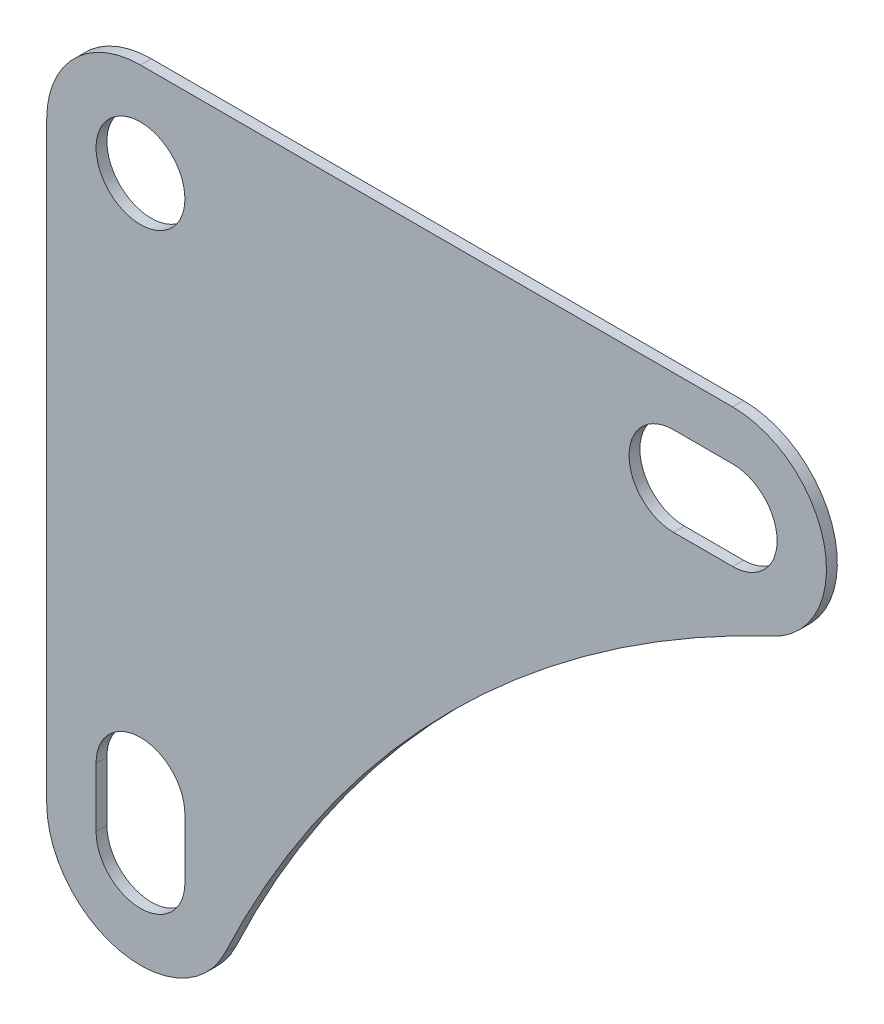
ISO-10303-21;
HEADER;
FILE_DESCRIPTION(('STEP AP214'),'2;1');
FILE_NAME('part.step','',(''),(''),'','','');
FILE_SCHEMA(('AUTOMOTIVE_DESIGN { 1 0 10303 214 1 1 1 1 }'));
ENDSEC;
DATA;
#1=APPLICATION_CONTEXT('core data for automotive mechanical design processes');
#2=APPLICATION_PROTOCOL_DEFINITION('international standard','automotive_design',2000,#1);
#3=PRODUCT_CONTEXT('',#1,'mechanical');
#4=PRODUCT('Part','Part','',(#3));
#5=PRODUCT_RELATED_PRODUCT_CATEGORY('part','',(#4));
#6=PRODUCT_DEFINITION_FORMATION('','',#4);
#7=PRODUCT_DEFINITION_CONTEXT('part definition',#1,'design');
#8=PRODUCT_DEFINITION('design','',#6,#7);
#9=PRODUCT_DEFINITION_SHAPE('','',#8);
#10=(LENGTH_UNIT() NAMED_UNIT(*) SI_UNIT(.MILLI.,.METRE.));
#11=(NAMED_UNIT(*) PLANE_ANGLE_UNIT() SI_UNIT($,.RADIAN.));
#12=(NAMED_UNIT(*) SI_UNIT($,.STERADIAN.) SOLID_ANGLE_UNIT());
#13=UNCERTAINTY_MEASURE_WITH_UNIT(LENGTH_MEASURE(1.E-05),#10,'distance_accuracy_value','');
#14=(GEOMETRIC_REPRESENTATION_CONTEXT(3) GLOBAL_UNCERTAINTY_ASSIGNED_CONTEXT((#13)) GLOBAL_UNIT_ASSIGNED_CONTEXT((#10,
#11,#12)) REPRESENTATION_CONTEXT('',''));
#15=CARTESIAN_POINT('',(0.,0.,0.));
#16=DIRECTION('',(0.,0.,1.));
#17=DIRECTION('',(1.,0.,0.));
#18=AXIS2_PLACEMENT_3D('',#15,#16,#17);
#19=CARTESIAN_POINT('',(0.,-60.,-1.1));
#20=DIRECTION('',(0.,0.,1.));
#21=DIRECTION('',(1.,0.,0.));
#22=AXIS2_PLACEMENT_3D('',#19,#20,#21);
#23=CYLINDRICAL_SURFACE('',#22,9.5);
#24=CARTESIAN_POINT('',(0.,-60.,0.));
#25=DIRECTION('',(0.,0.,1.));
#26=DIRECTION('',(-1.,0.,0.));
#27=AXIS2_PLACEMENT_3D('',#24,#25,#26);
#28=CIRCLE('',#27,9.5);
#29=CARTESIAN_POINT('',(-9.5,-60.,0.));
#30=VERTEX_POINT('',#29);
#31=CARTESIAN_POINT('',(8.59988878912675,-64.0363241711552,0.));
#32=VERTEX_POINT('',#31);
#33=EDGE_CURVE('E206',#30,#32,#28,.T.);
#34=ORIENTED_EDGE('',*,*,#33,.F.);
#35=DIRECTION('',(0.,0.,1.));
#36=VECTOR('',#35,1.);
#37=CARTESIAN_POINT('',(-9.5,-60.,-1.1));
#38=LINE('',#37,#36);
#39=CARTESIAN_POINT('',(-9.5,-60.,-1.1));
#40=VERTEX_POINT('',#39);
#41=EDGE_CURVE('E11',#40,#30,#38,.T.);
#42=ORIENTED_EDGE('',*,*,#41,.F.);
#43=CARTESIAN_POINT('',(0.,-60.,-1.1));
#44=DIRECTION('',(0.,0.,1.));
#45=DIRECTION('',(-1.,0.,0.));
#46=AXIS2_PLACEMENT_3D('',#43,#44,#45);
#47=CIRCLE('',#46,9.5);
#48=CARTESIAN_POINT('',(8.59988878912675,-64.0363241711552,-1.1));
#49=VERTEX_POINT('',#48);
#50=EDGE_CURVE('E209',#40,#49,#47,.T.);
#51=ORIENTED_EDGE('',*,*,#50,.T.);
#52=DIRECTION('',(0.,0.,1.));
#53=VECTOR('',#52,1.);
#54=CARTESIAN_POINT('',(8.59988878912675,-64.0363241711552,-1.1));
#55=LINE('',#54,#53);
#56=EDGE_CURVE('E36',#49,#32,#55,.T.);
#57=ORIENTED_EDGE('',*,*,#56,.T.);
#58=EDGE_LOOP('',(#34,#42,#51,#57));
#59=FACE_BOUND('',#58,.T.);
#60=ADVANCED_FACE('F33',(#59),#23,.T.);
#61=CARTESIAN_POINT('',(-9.5,-60.,-1.1));
#62=DIRECTION('',(-1.,0.,0.));
#63=DIRECTION('',(0.,-1.,0.));
#64=AXIS2_PLACEMENT_3D('',#61,#62,#63);
#65=PLANE('',#64);
#66=DIRECTION('',(0.,-1.,0.));
#67=VECTOR('',#66,1.);
#68=CARTESIAN_POINT('',(-9.5,-60.,0.));
#69=LINE('',#68,#67);
#70=CARTESIAN_POINT('',(-9.5,0.,0.));
#71=VERTEX_POINT('',#70);
#72=EDGE_CURVE('E213',#71,#30,#69,.T.);
#73=ORIENTED_EDGE('',*,*,#72,.F.);
#74=DIRECTION('',(0.,0.,1.));
#75=VECTOR('',#74,1.);
#76=CARTESIAN_POINT('',(-9.5,0.,-1.1));
#77=LINE('',#76,#75);
#78=CARTESIAN_POINT('',(-9.5,0.,-1.1));
#79=VERTEX_POINT('',#78);
#80=EDGE_CURVE('E41',#79,#71,#77,.T.);
#81=ORIENTED_EDGE('',*,*,#80,.F.);
#82=DIRECTION('',(0.,-1.,0.));
#83=VECTOR('',#82,1.);
#84=CARTESIAN_POINT('',(-9.5,-60.,-1.1));
#85=LINE('',#84,#83);
#86=EDGE_CURVE('E225',#79,#40,#85,.T.);
#87=ORIENTED_EDGE('',*,*,#86,.T.);
#88=ORIENTED_EDGE('',*,*,#41,.T.);
#89=EDGE_LOOP('',(#73,#81,#87,#88));
#90=FACE_BOUND('',#89,.T.);
#91=ADVANCED_FACE('F262',(#90),#65,.T.);
#92=CARTESIAN_POINT('',(0.,0.,-1.1));
#93=DIRECTION('',(0.,0.,1.));
#94=DIRECTION('',(1.,0.,0.));
#95=AXIS2_PLACEMENT_3D('',#92,#93,#94);
#96=CYLINDRICAL_SURFACE('',#95,9.5);
#97=CARTESIAN_POINT('',(0.,0.,0.));
#98=DIRECTION('',(0.,0.,1.));
#99=DIRECTION('',(-1.,0.,0.));
#100=AXIS2_PLACEMENT_3D('',#97,#98,#99);
#101=CIRCLE('',#100,9.5);
#102=CARTESIAN_POINT('',(0.,9.5,0.));
#103=VERTEX_POINT('',#102);
#104=EDGE_CURVE('E239',#103,#71,#101,.T.);
#105=ORIENTED_EDGE('',*,*,#104,.F.);
#106=DIRECTION('',(0.,0.,1.));
#107=VECTOR('',#106,1.);
#108=CARTESIAN_POINT('',(0.,9.5,-1.1));
#109=LINE('',#108,#107);
#110=CARTESIAN_POINT('',(0.,9.5,-1.1));
#111=VERTEX_POINT('',#110);
#112=EDGE_CURVE('E245',#111,#103,#109,.T.);
#113=ORIENTED_EDGE('',*,*,#112,.F.);
#114=CARTESIAN_POINT('',(0.,0.,-1.1));
#115=DIRECTION('',(0.,0.,1.));
#116=DIRECTION('',(-1.,0.,0.));
#117=AXIS2_PLACEMENT_3D('',#114,#115,#116);
#118=CIRCLE('',#117,9.5);
#119=EDGE_CURVE('E222',#111,#79,#118,.T.);
#120=ORIENTED_EDGE('',*,*,#119,.T.);
#121=ORIENTED_EDGE('',*,*,#80,.T.);
#122=EDGE_LOOP('',(#105,#113,#120,#121));
#123=FACE_BOUND('',#122,.T.);
#124=ADVANCED_FACE('F274',(#123),#96,.T.);
#125=CARTESIAN_POINT('',(0.,9.5,-1.1));
#126=DIRECTION('',(0.,1.,0.));
#127=DIRECTION('',(-1.,0.,0.));
#128=AXIS2_PLACEMENT_3D('',#125,#126,#127);
#129=PLANE('',#128);
#130=DIRECTION('',(-1.,0.,0.));
#131=VECTOR('',#130,1.);
#132=CARTESIAN_POINT('',(0.,9.5,0.));
#133=LINE('',#132,#131);
#134=CARTESIAN_POINT('',(60.,9.5,0.));
#135=VERTEX_POINT('',#134);
#136=EDGE_CURVE('E236',#135,#103,#133,.T.);
#137=ORIENTED_EDGE('',*,*,#136,.F.);
#138=DIRECTION('',(0.,0.,1.));
#139=VECTOR('',#138,1.);
#140=CARTESIAN_POINT('',(60.,9.5,-1.1));
#141=LINE('',#140,#139);
#142=CARTESIAN_POINT('',(60.,9.5,-1.1));
#143=VERTEX_POINT('',#142);
#144=EDGE_CURVE('E247',#143,#135,#141,.T.);
#145=ORIENTED_EDGE('',*,*,#144,.F.);
#146=DIRECTION('',(-1.,0.,0.));
#147=VECTOR('',#146,1.);
#148=CARTESIAN_POINT('',(0.,9.5,-1.1));
#149=LINE('',#148,#147);
#150=EDGE_CURVE('E219',#143,#111,#149,.T.);
#151=ORIENTED_EDGE('',*,*,#150,.T.);
#152=ORIENTED_EDGE('',*,*,#112,.T.);
#153=EDGE_LOOP('',(#137,#145,#151,#152));
#154=FACE_BOUND('',#153,.T.);
#155=ADVANCED_FACE('F272',(#154),#129,.T.);
#156=CARTESIAN_POINT('',(60.,0.,-1.1));
#157=DIRECTION('',(0.,0.,1.));
#158=DIRECTION('',(1.,0.,0.));
#159=AXIS2_PLACEMENT_3D('',#156,#157,#158);
#160=CYLINDRICAL_SURFACE('',#159,9.5);
#161=CARTESIAN_POINT('',(60.,0.,0.));
#162=DIRECTION('',(0.,0.,1.));
#163=DIRECTION('',(-1.,0.,0.));
#164=AXIS2_PLACEMENT_3D('',#161,#162,#163);
#165=CIRCLE('',#164,9.5);
#166=CARTESIAN_POINT('',(64.0363241711552,-8.59988878912676,0.));
#167=VERTEX_POINT('',#166);
#168=EDGE_CURVE('E233',#167,#135,#165,.T.);
#169=ORIENTED_EDGE('',*,*,#168,.F.);
#170=DIRECTION('',(0.,0.,1.));
#171=VECTOR('',#170,1.);
#172=CARTESIAN_POINT('',(64.0363241711552,-8.59988878912676,-1.1));
#173=LINE('',#172,#171);
#174=CARTESIAN_POINT('',(64.0363241711552,-8.59988878912676,-1.1));
#175=VERTEX_POINT('',#174);
#176=EDGE_CURVE('E248',#175,#167,#173,.T.);
#177=ORIENTED_EDGE('',*,*,#176,.F.);
#178=CARTESIAN_POINT('',(60.,0.,-1.1));
#179=DIRECTION('',(0.,0.,1.));
#180=DIRECTION('',(-1.,0.,0.));
#181=AXIS2_PLACEMENT_3D('',#178,#179,#180);
#182=CIRCLE('',#181,9.5);
#183=EDGE_CURVE('E216',#175,#143,#182,.T.);
#184=ORIENTED_EDGE('',*,*,#183,.T.);
#185=ORIENTED_EDGE('',*,*,#144,.T.);
#186=EDGE_LOOP('',(#169,#177,#184,#185));
#187=FACE_BOUND('',#186,.T.);
#188=ADVANCED_FACE('F269',(#187),#160,.T.);
#189=CARTESIAN_POINT('',(113.06804450968,-113.06804450968,-1.1));
#190=DIRECTION('',(0.,0.,1.));
#191=DIRECTION('',(1.,0.,0.));
#192=AXIS2_PLACEMENT_3D('',#189,#190,#191);
#193=CYLINDRICAL_SURFACE('',#192,115.402362016594);
#194=CARTESIAN_POINT('',(113.06804450968,-113.06804450968,0.));
#195=DIRECTION('',(0.,0.,-1.));
#196=DIRECTION('',(-1.,0.,0.));
#197=AXIS2_PLACEMENT_3D('',#194,#195,#196);
#198=CIRCLE('',#197,115.402362016594);
#199=EDGE_CURVE('E230',#32,#167,#198,.T.);
#200=ORIENTED_EDGE('',*,*,#199,.F.);
#201=ORIENTED_EDGE('',*,*,#56,.F.);
#202=CARTESIAN_POINT('',(113.06804450968,-113.06804450968,-1.1));
#203=DIRECTION('',(0.,0.,-1.));
#204=DIRECTION('',(-1.,0.,0.));
#205=AXIS2_PLACEMENT_3D('',#202,#203,#204);
#206=CIRCLE('',#205,115.402362016594);
#207=EDGE_CURVE('E212',#49,#175,#206,.T.);
#208=ORIENTED_EDGE('',*,*,#207,.T.);
#209=ORIENTED_EDGE('',*,*,#176,.T.);
#210=EDGE_LOOP('',(#200,#201,#208,#209));
#211=FACE_BOUND('',#210,.T.);
#212=ADVANCED_FACE('F256',(#211),#193,.F.);
#213=CARTESIAN_POINT('',(0.,-60.,-1.1));
#214=DIRECTION('',(0.,0.,-1.));
#215=DIRECTION('',(-1.,0.,0.));
#216=AXIS2_PLACEMENT_3D('',#213,#214,#215);
#217=PLANE('',#216);
#218=CARTESIAN_POINT('',(60.,0.,-1.1));
#219=DIRECTION('',(0.,0.,1.));
#220=DIRECTION('',(1.,0.,0.));
#221=AXIS2_PLACEMENT_3D('',#218,#219,#220);
#222=CIRCLE('',#221,4.5);
#223=CARTESIAN_POINT('',(60.,-4.5,-1.1));
#224=VERTEX_POINT('',#223);
#225=CARTESIAN_POINT('',(60.,4.5,-1.1));
#226=VERTEX_POINT('',#225);
#227=EDGE_CURVE('E136',#224,#226,#222,.T.);
#228=ORIENTED_EDGE('',*,*,#227,.T.);
#229=DIRECTION('',(-1.,0.,0.));
#230=VECTOR('',#229,1.);
#231=CARTESIAN_POINT('',(60.,4.5,-1.1));
#232=LINE('',#231,#230);
#233=CARTESIAN_POINT('',(54.,4.5,-1.1));
#234=VERTEX_POINT('',#233);
#235=EDGE_CURVE('E145',#226,#234,#232,.T.);
#236=ORIENTED_EDGE('',*,*,#235,.T.);
#237=CARTESIAN_POINT('',(54.,0.,-1.1));
#238=DIRECTION('',(0.,0.,1.));
#239=DIRECTION('',(1.,0.,0.));
#240=AXIS2_PLACEMENT_3D('',#237,#238,#239);
#241=CIRCLE('',#240,4.5);
#242=CARTESIAN_POINT('',(54.,-4.5,-1.1));
#243=VERTEX_POINT('',#242);
#244=EDGE_CURVE('E49',#234,#243,#241,.T.);
#245=ORIENTED_EDGE('',*,*,#244,.T.);
#246=DIRECTION('',(1.,0.,0.));
#247=VECTOR('',#246,1.);
#248=CARTESIAN_POINT('',(60.,-4.5,-1.1));
#249=LINE('',#248,#247);
#250=EDGE_CURVE('E142',#243,#224,#249,.T.);
#251=ORIENTED_EDGE('',*,*,#250,.T.);
#252=EDGE_LOOP('',(#228,#236,#245,#251));
#253=FACE_BOUND('',#252,.T.);
#254=CARTESIAN_POINT('',(0.,-60.,-1.1));
#255=DIRECTION('',(0.,0.,1.));
#256=DIRECTION('',(1.,0.,0.));
#257=AXIS2_PLACEMENT_3D('',#254,#255,#256);
#258=CIRCLE('',#257,4.5);
#259=CARTESIAN_POINT('',(-4.5,-60.,-1.1));
#260=VERTEX_POINT('',#259);
#261=CARTESIAN_POINT('',(4.5,-60.,-1.1));
#262=VERTEX_POINT('',#261);
#263=EDGE_CURVE('E171',#260,#262,#258,.T.);
#264=ORIENTED_EDGE('',*,*,#263,.T.);
#265=DIRECTION('',(0.,1.,0.));
#266=VECTOR('',#265,1.);
#267=CARTESIAN_POINT('',(4.5,-60.,-1.1));
#268=LINE('',#267,#266);
#269=CARTESIAN_POINT('',(4.5,-54.,-1.1));
#270=VERTEX_POINT('',#269);
#271=EDGE_CURVE('E174',#262,#270,#268,.T.);
#272=ORIENTED_EDGE('',*,*,#271,.T.);
#273=CARTESIAN_POINT('',(0.,-54.,-1.1));
#274=DIRECTION('',(0.,0.,1.));
#275=DIRECTION('',(1.,0.,0.));
#276=AXIS2_PLACEMENT_3D('',#273,#274,#275);
#277=CIRCLE('',#276,4.5);
#278=CARTESIAN_POINT('',(-4.5,-54.,-1.1));
#279=VERTEX_POINT('',#278);
#280=EDGE_CURVE('E178',#270,#279,#277,.T.);
#281=ORIENTED_EDGE('',*,*,#280,.T.);
#282=DIRECTION('',(0.,-1.,0.));
#283=VECTOR('',#282,1.);
#284=CARTESIAN_POINT('',(-4.5,-60.,-1.1));
#285=LINE('',#284,#283);
#286=EDGE_CURVE('E181',#279,#260,#285,.T.);
#287=ORIENTED_EDGE('',*,*,#286,.T.);
#288=EDGE_LOOP('',(#264,#272,#281,#287));
#289=FACE_BOUND('',#288,.T.);
#290=CARTESIAN_POINT('',(0.,0.,-1.1));
#291=DIRECTION('',(0.,0.,1.));
#292=DIRECTION('',(1.,0.,0.));
#293=AXIS2_PLACEMENT_3D('',#290,#291,#292);
#294=CIRCLE('',#293,4.5);
#295=CARTESIAN_POINT('',(4.5,0.,-1.1));
#296=VERTEX_POINT('',#295);
#297=EDGE_CURVE('E203',#296,#296,#294,.T.);
#298=ORIENTED_EDGE('',*,*,#297,.T.);
#299=EDGE_LOOP('',(#298));
#300=FACE_BOUND('',#299,.T.);
#301=ORIENTED_EDGE('',*,*,#50,.F.);
#302=ORIENTED_EDGE('',*,*,#86,.F.);
#303=ORIENTED_EDGE('',*,*,#119,.F.);
#304=ORIENTED_EDGE('',*,*,#150,.F.);
#305=ORIENTED_EDGE('',*,*,#183,.F.);
#306=ORIENTED_EDGE('',*,*,#207,.F.);
#307=EDGE_LOOP('',(#301,#302,#303,#304,#305,#306));
#308=FACE_BOUND('',#307,.T.);
#309=ADVANCED_FACE('F149',(#253,#289,#300,#308),#217,.T.);
#310=CARTESIAN_POINT('',(0.,-60.,0.));
#311=DIRECTION('',(0.,0.,-1.));
#312=DIRECTION('',(-1.,0.,0.));
#313=AXIS2_PLACEMENT_3D('',#310,#311,#312);
#314=PLANE('',#313);
#315=DIRECTION('',(-1.,0.,0.));
#316=VECTOR('',#315,1.);
#317=CARTESIAN_POINT('',(60.,4.5,0.));
#318=LINE('',#317,#316);
#319=CARTESIAN_POINT('',(60.,4.5,0.));
#320=VERTEX_POINT('',#319);
#321=CARTESIAN_POINT('',(54.,4.5,0.));
#322=VERTEX_POINT('',#321);
#323=EDGE_CURVE('E161',#320,#322,#318,.T.);
#324=ORIENTED_EDGE('',*,*,#323,.F.);
#325=CARTESIAN_POINT('',(60.,0.,0.));
#326=DIRECTION('',(0.,0.,1.));
#327=DIRECTION('',(1.,0.,0.));
#328=AXIS2_PLACEMENT_3D('',#325,#326,#327);
#329=CIRCLE('',#328,4.5);
#330=CARTESIAN_POINT('',(60.,-4.5,0.));
#331=VERTEX_POINT('',#330);
#332=EDGE_CURVE('E57',#331,#320,#329,.T.);
#333=ORIENTED_EDGE('',*,*,#332,.F.);
#334=DIRECTION('',(1.,0.,0.));
#335=VECTOR('',#334,1.);
#336=CARTESIAN_POINT('',(60.,-4.5,0.));
#337=LINE('',#336,#335);
#338=CARTESIAN_POINT('',(54.,-4.5,0.));
#339=VERTEX_POINT('',#338);
#340=EDGE_CURVE('E152',#339,#331,#337,.T.);
#341=ORIENTED_EDGE('',*,*,#340,.F.);
#342=CARTESIAN_POINT('',(54.,0.,0.));
#343=DIRECTION('',(0.,0.,1.));
#344=DIRECTION('',(1.,0.,0.));
#345=AXIS2_PLACEMENT_3D('',#342,#343,#344);
#346=CIRCLE('',#345,4.5);
#347=EDGE_CURVE('E155',#322,#339,#346,.T.);
#348=ORIENTED_EDGE('',*,*,#347,.F.);
#349=EDGE_LOOP('',(#324,#333,#341,#348));
#350=FACE_BOUND('',#349,.T.);
#351=DIRECTION('',(0.,1.,0.));
#352=VECTOR('',#351,1.);
#353=CARTESIAN_POINT('',(4.5,-60.,0.));
#354=LINE('',#353,#352);
#355=CARTESIAN_POINT('',(4.5,-60.,0.));
#356=VERTEX_POINT('',#355);
#357=CARTESIAN_POINT('',(4.5,-54.,0.));
#358=VERTEX_POINT('',#357);
#359=EDGE_CURVE('E186',#356,#358,#354,.T.);
#360=ORIENTED_EDGE('',*,*,#359,.F.);
#361=CARTESIAN_POINT('',(0.,-60.,0.));
#362=DIRECTION('',(0.,0.,1.));
#363=DIRECTION('',(1.,0.,0.));
#364=AXIS2_PLACEMENT_3D('',#361,#362,#363);
#365=CIRCLE('',#364,4.5);
#366=CARTESIAN_POINT('',(-4.5,-60.,0.));
#367=VERTEX_POINT('',#366);
#368=EDGE_CURVE('E167',#367,#356,#365,.T.);
#369=ORIENTED_EDGE('',*,*,#368,.F.);
#370=DIRECTION('',(0.,-1.,0.));
#371=VECTOR('',#370,1.);
#372=CARTESIAN_POINT('',(-4.5,-60.,0.));
#373=LINE('',#372,#371);
#374=CARTESIAN_POINT('',(-4.5,-54.,0.));
#375=VERTEX_POINT('',#374);
#376=EDGE_CURVE('E175',#375,#367,#373,.T.);
#377=ORIENTED_EDGE('',*,*,#376,.F.);
#378=CARTESIAN_POINT('',(0.,-54.,0.));
#379=DIRECTION('',(0.,0.,1.));
#380=DIRECTION('',(1.,0.,0.));
#381=AXIS2_PLACEMENT_3D('',#378,#379,#380);
#382=CIRCLE('',#381,4.5);
#383=EDGE_CURVE('E189',#358,#375,#382,.T.);
#384=ORIENTED_EDGE('',*,*,#383,.F.);
#385=EDGE_LOOP('',(#360,#369,#377,#384));
#386=FACE_BOUND('',#385,.T.);
#387=CARTESIAN_POINT('',(0.,0.,0.));
#388=DIRECTION('',(0.,0.,1.));
#389=DIRECTION('',(1.,0.,0.));
#390=AXIS2_PLACEMENT_3D('',#387,#388,#389);
#391=CIRCLE('',#390,4.5);
#392=CARTESIAN_POINT('',(4.5,0.,0.));
#393=VERTEX_POINT('',#392);
#394=EDGE_CURVE('E196',#393,#393,#391,.T.);
#395=ORIENTED_EDGE('',*,*,#394,.F.);
#396=EDGE_LOOP('',(#395));
#397=FACE_BOUND('',#396,.T.);
#398=ORIENTED_EDGE('',*,*,#33,.T.);
#399=ORIENTED_EDGE('',*,*,#199,.T.);
#400=ORIENTED_EDGE('',*,*,#168,.T.);
#401=ORIENTED_EDGE('',*,*,#136,.T.);
#402=ORIENTED_EDGE('',*,*,#104,.T.);
#403=ORIENTED_EDGE('',*,*,#72,.T.);
#404=EDGE_LOOP('',(#398,#399,#400,#401,#402,#403));
#405=FACE_BOUND('',#404,.T.);
#406=ADVANCED_FACE('F258',(#350,#386,#397,#405),#314,.F.);
#407=CARTESIAN_POINT('',(0.,0.,-1.1));
#408=DIRECTION('',(0.,0.,1.));
#409=DIRECTION('',(1.,0.,0.));
#410=AXIS2_PLACEMENT_3D('',#407,#408,#409);
#411=CYLINDRICAL_SURFACE('',#410,4.5);
#412=ORIENTED_EDGE('',*,*,#297,.F.);
#413=EDGE_LOOP('',(#412));
#414=FACE_BOUND('',#413,.T.);
#415=ORIENTED_EDGE('',*,*,#394,.T.);
#416=EDGE_LOOP('',(#415));
#417=FACE_BOUND('',#416,.T.);
#418=ADVANCED_FACE('F332',(#414,#417),#411,.F.);
#419=CARTESIAN_POINT('',(0.,-60.,-1.1));
#420=DIRECTION('',(0.,0.,1.));
#421=DIRECTION('',(1.,0.,0.));
#422=AXIS2_PLACEMENT_3D('',#419,#420,#421);
#423=CYLINDRICAL_SURFACE('',#422,4.5);
#424=ORIENTED_EDGE('',*,*,#368,.T.);
#425=DIRECTION('',(0.,0.,1.));
#426=VECTOR('',#425,1.);
#427=CARTESIAN_POINT('',(4.5,-60.,-1.1));
#428=LINE('',#427,#426);
#429=EDGE_CURVE('E184',#262,#356,#428,.T.);
#430=ORIENTED_EDGE('',*,*,#429,.F.);
#431=ORIENTED_EDGE('',*,*,#263,.F.);
#432=DIRECTION('',(0.,0.,1.));
#433=VECTOR('',#432,1.);
#434=CARTESIAN_POINT('',(-4.5,-60.,-1.1));
#435=LINE('',#434,#433);
#436=EDGE_CURVE('E194',#260,#367,#435,.T.);
#437=ORIENTED_EDGE('',*,*,#436,.T.);
#438=EDGE_LOOP('',(#424,#430,#431,#437));
#439=FACE_BOUND('',#438,.T.);
#440=ADVANCED_FACE('F342',(#439),#423,.F.);
#441=CARTESIAN_POINT('',(-4.5,-60.,-1.1));
#442=DIRECTION('',(-1.,0.,0.));
#443=DIRECTION('',(0.,-1.,0.));
#444=AXIS2_PLACEMENT_3D('',#441,#442,#443);
#445=PLANE('',#444);
#446=ORIENTED_EDGE('',*,*,#376,.T.);
#447=ORIENTED_EDGE('',*,*,#436,.F.);
#448=ORIENTED_EDGE('',*,*,#286,.F.);
#449=DIRECTION('',(0.,0.,1.));
#450=VECTOR('',#449,1.);
#451=CARTESIAN_POINT('',(-4.5,-54.,-1.1));
#452=LINE('',#451,#450);
#453=EDGE_CURVE('E197',#279,#375,#452,.T.);
#454=ORIENTED_EDGE('',*,*,#453,.T.);
#455=EDGE_LOOP('',(#446,#447,#448,#454));
#456=FACE_BOUND('',#455,.T.);
#457=ADVANCED_FACE('F352',(#456),#445,.F.);
#458=CARTESIAN_POINT('',(0.,-54.,-1.1));
#459=DIRECTION('',(0.,0.,1.));
#460=DIRECTION('',(1.,0.,0.));
#461=AXIS2_PLACEMENT_3D('',#458,#459,#460);
#462=CYLINDRICAL_SURFACE('',#461,4.5);
#463=ORIENTED_EDGE('',*,*,#383,.T.);
#464=ORIENTED_EDGE('',*,*,#453,.F.);
#465=ORIENTED_EDGE('',*,*,#280,.F.);
#466=DIRECTION('',(0.,0.,1.));
#467=VECTOR('',#466,1.);
#468=CARTESIAN_POINT('',(4.5,-54.,-1.1));
#469=LINE('',#468,#467);
#470=EDGE_CURVE('E199',#270,#358,#469,.T.);
#471=ORIENTED_EDGE('',*,*,#470,.T.);
#472=EDGE_LOOP('',(#463,#464,#465,#471));
#473=FACE_BOUND('',#472,.T.);
#474=ADVANCED_FACE('F362',(#473),#462,.F.);
#475=CARTESIAN_POINT('',(4.5,-60.,-1.1));
#476=DIRECTION('',(1.,0.,0.));
#477=DIRECTION('',(0.,1.,0.));
#478=AXIS2_PLACEMENT_3D('',#475,#476,#477);
#479=PLANE('',#478);
#480=ORIENTED_EDGE('',*,*,#359,.T.);
#481=ORIENTED_EDGE('',*,*,#470,.F.);
#482=ORIENTED_EDGE('',*,*,#271,.F.);
#483=ORIENTED_EDGE('',*,*,#429,.T.);
#484=EDGE_LOOP('',(#480,#481,#482,#483));
#485=FACE_BOUND('',#484,.T.);
#486=ADVANCED_FACE('F372',(#485),#479,.F.);
#487=CARTESIAN_POINT('',(60.,0.,-1.1));
#488=DIRECTION('',(0.,0.,1.));
#489=DIRECTION('',(1.,0.,0.));
#490=AXIS2_PLACEMENT_3D('',#487,#488,#489);
#491=CYLINDRICAL_SURFACE('',#490,4.5);
#492=ORIENTED_EDGE('',*,*,#332,.T.);
#493=DIRECTION('',(0.,0.,1.));
#494=VECTOR('',#493,1.);
#495=CARTESIAN_POINT('',(60.,4.5,-1.1));
#496=LINE('',#495,#494);
#497=EDGE_CURVE('E132',#226,#320,#496,.T.);
#498=ORIENTED_EDGE('',*,*,#497,.F.);
#499=ORIENTED_EDGE('',*,*,#227,.F.);
#500=DIRECTION('',(0.,0.,1.));
#501=VECTOR('',#500,1.);
#502=CARTESIAN_POINT('',(60.,-4.5,-1.1));
#503=LINE('',#502,#501);
#504=EDGE_CURVE('E165',#224,#331,#503,.T.);
#505=ORIENTED_EDGE('',*,*,#504,.T.);
#506=EDGE_LOOP('',(#492,#498,#499,#505));
#507=FACE_BOUND('',#506,.T.);
#508=ADVANCED_FACE('F134',(#507),#491,.F.);
#509=CARTESIAN_POINT('',(60.,-4.5,-1.1));
#510=DIRECTION('',(0.,-1.,0.));
#511=DIRECTION('',(1.,0.,0.));
#512=AXIS2_PLACEMENT_3D('',#509,#510,#511);
#513=PLANE('',#512);
#514=ORIENTED_EDGE('',*,*,#340,.T.);
#515=ORIENTED_EDGE('',*,*,#504,.F.);
#516=ORIENTED_EDGE('',*,*,#250,.F.);
#517=DIRECTION('',(0.,0.,1.));
#518=VECTOR('',#517,1.);
#519=CARTESIAN_POINT('',(54.,-4.5,-1.1));
#520=LINE('',#519,#518);
#521=EDGE_CURVE('E168',#243,#339,#520,.T.);
#522=ORIENTED_EDGE('',*,*,#521,.T.);
#523=EDGE_LOOP('',(#514,#515,#516,#522));
#524=FACE_BOUND('',#523,.T.);
#525=ADVANCED_FACE('F391',(#524),#513,.F.);
#526=CARTESIAN_POINT('',(54.,0.,-1.1));
#527=DIRECTION('',(0.,0.,1.));
#528=DIRECTION('',(1.,0.,0.));
#529=AXIS2_PLACEMENT_3D('',#526,#527,#528);
#530=CYLINDRICAL_SURFACE('',#529,4.5);
#531=ORIENTED_EDGE('',*,*,#347,.T.);
#532=ORIENTED_EDGE('',*,*,#521,.F.);
#533=ORIENTED_EDGE('',*,*,#244,.F.);
#534=DIRECTION('',(0.,0.,1.));
#535=VECTOR('',#534,1.);
#536=CARTESIAN_POINT('',(54.,4.5,-1.1));
#537=LINE('',#536,#535);
#538=EDGE_CURVE('E141',#234,#322,#537,.T.);
#539=ORIENTED_EDGE('',*,*,#538,.T.);
#540=EDGE_LOOP('',(#531,#532,#533,#539));
#541=FACE_BOUND('',#540,.T.);
#542=ADVANCED_FACE('F400',(#541),#530,.F.);
#543=CARTESIAN_POINT('',(60.,4.5,-1.1));
#544=DIRECTION('',(0.,1.,0.));
#545=DIRECTION('',(-1.,0.,0.));
#546=AXIS2_PLACEMENT_3D('',#543,#544,#545);
#547=PLANE('',#546);
#548=ORIENTED_EDGE('',*,*,#323,.T.);
#549=ORIENTED_EDGE('',*,*,#538,.F.);
#550=ORIENTED_EDGE('',*,*,#235,.F.);
#551=ORIENTED_EDGE('',*,*,#497,.T.);
#552=EDGE_LOOP('',(#548,#549,#550,#551));
#553=FACE_BOUND('',#552,.T.);
#554=ADVANCED_FACE('F146',(#553),#547,.F.);
#555=CLOSED_SHELL('',(#60,#91,#124,#155,#188,#212,#309,#406,#418,#440,#457,#474,#486,#508,#525,
#542,#554));
#556=MANIFOLD_SOLID_BREP('B2',#555);
#557=ADVANCED_BREP_SHAPE_REPRESENTATION('',(#18,#556),#14);
#558=SHAPE_DEFINITION_REPRESENTATION(#9,#557);
ENDSEC;
END-ISO-10303-21;
